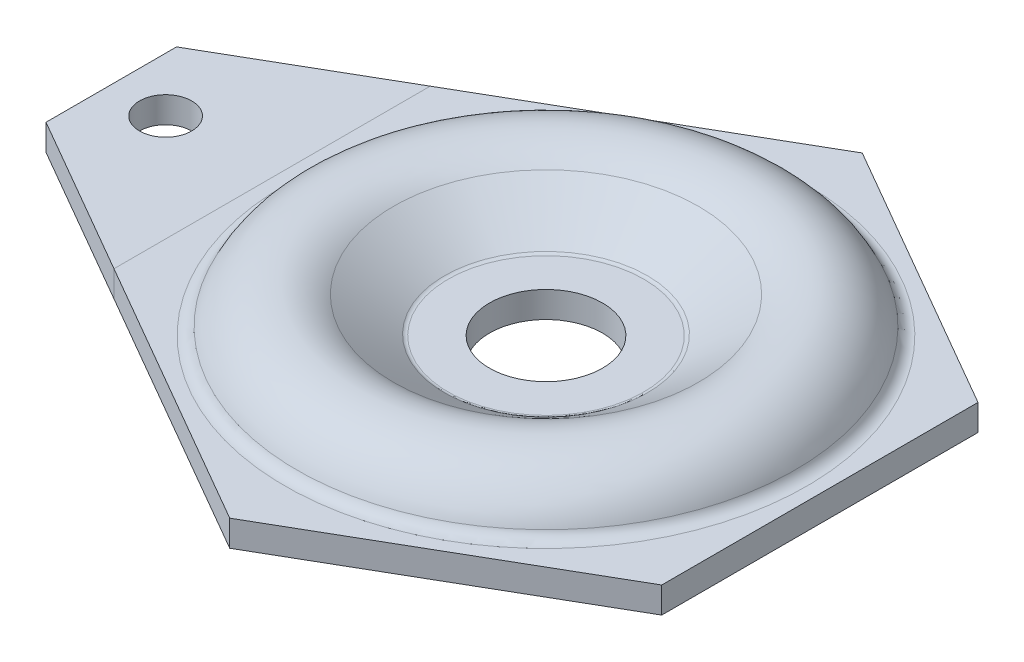
ISO-10303-21;
HEADER;
FILE_DESCRIPTION(('STEP AP214'),'2;1');
FILE_NAME('part.step','',(''),(''),'','','');
FILE_SCHEMA(('AUTOMOTIVE_DESIGN { 1 0 10303 214 1 1 1 1 }'));
ENDSEC;
DATA;
#1=APPLICATION_CONTEXT('core data for automotive mechanical design processes');
#2=APPLICATION_PROTOCOL_DEFINITION('international standard','automotive_design',2000,#1);
#3=PRODUCT_CONTEXT('',#1,'mechanical');
#4=PRODUCT('Part','Part','',(#3));
#5=PRODUCT_RELATED_PRODUCT_CATEGORY('part','',(#4));
#6=PRODUCT_DEFINITION_FORMATION('','',#4);
#7=PRODUCT_DEFINITION_CONTEXT('part definition',#1,'design');
#8=PRODUCT_DEFINITION('design','',#6,#7);
#9=PRODUCT_DEFINITION_SHAPE('','',#8);
#10=(LENGTH_UNIT() NAMED_UNIT(*) SI_UNIT(.MILLI.,.METRE.));
#11=(NAMED_UNIT(*) PLANE_ANGLE_UNIT() SI_UNIT($,.RADIAN.));
#12=(NAMED_UNIT(*) SI_UNIT($,.STERADIAN.) SOLID_ANGLE_UNIT());
#13=UNCERTAINTY_MEASURE_WITH_UNIT(LENGTH_MEASURE(1.E-05),#10,'distance_accuracy_value','');
#14=(GEOMETRIC_REPRESENTATION_CONTEXT(3) GLOBAL_UNCERTAINTY_ASSIGNED_CONTEXT((#13)) GLOBAL_UNIT_ASSIGNED_CONTEXT((#10,
#11,#12)) REPRESENTATION_CONTEXT('',''));
#15=CARTESIAN_POINT('',(0.,0.,0.));
#16=DIRECTION('',(0.,0.,1.));
#17=DIRECTION('',(1.,0.,0.));
#18=AXIS2_PLACEMENT_3D('',#15,#16,#17);
#19=CARTESIAN_POINT('',(-126.,273.916758940791,0.));
#20=DIRECTION('',(0.5,0.,-0.866025403784439));
#21=DIRECTION('',(-0.866025403784439,0.,-0.5));
#22=AXIS2_PLACEMENT_3D('',#19,#20,#21);
#23=PLANE('',#22);
#24=DIRECTION('',(-0.866025403784439,0.,-0.5));
#25=VECTOR('',#24,1.);
#26=CARTESIAN_POINT('',(-122.25,0.,2.16506350946112));
#27=LINE('',#26,#25);
#28=CARTESIAN_POINT('',(-63.,0.,36.3730669589464));
#29=VERTEX_POINT('',#28);
#30=CARTESIAN_POINT('',(-100.,0.,15.0111069989303));
#31=VERTEX_POINT('',#30);
#32=EDGE_CURVE('E105',#29,#31,#27,.T.);
#33=ORIENTED_EDGE('',*,*,#32,.F.);
#34=DIRECTION('',(0.,1.,0.));
#35=VECTOR('',#34,1.);
#36=CARTESIAN_POINT('',(-63.,0.,36.3730669589464));
#37=LINE('',#36,#35);
#38=CARTESIAN_POINT('',(-63.,6.00000000000001,36.3730669589464));
#39=VERTEX_POINT('',#38);
#40=EDGE_CURVE('E97',#29,#39,#37,.T.);
#41=ORIENTED_EDGE('',*,*,#40,.T.);
#42=DIRECTION('',(0.866025403784439,0.,0.5));
#43=VECTOR('',#42,1.);
#44=CARTESIAN_POINT('',(-90.75,6.,20.3515969889343));
#45=LINE('',#44,#43);
#46=CARTESIAN_POINT('',(-100.,6.,15.0111069989303));
#47=VERTEX_POINT('',#46);
#48=EDGE_CURVE('E102',#47,#39,#45,.T.);
#49=ORIENTED_EDGE('',*,*,#48,.F.);
#50=DIRECTION('',(0.,-1.,0.));
#51=VECTOR('',#50,1.);
#52=CARTESIAN_POINT('',(-100.,0.,15.0111069989303));
#53=LINE('',#52,#51);
#54=EDGE_CURVE('E74',#47,#31,#53,.T.);
#55=ORIENTED_EDGE('',*,*,#54,.T.);
#56=EDGE_LOOP('',(#33,#41,#49,#55));
#57=FACE_BOUND('',#56,.T.);
#58=ADVANCED_FACE('F51',(#57),#23,.F.);
#59=CARTESIAN_POINT('',(-100.,0.,-36.3730669589464));
#60=DIRECTION('',(0.,1.,0.));
#61=DIRECTION('',(0.,0.,1.));
#62=AXIS2_PLACEMENT_3D('',#59,#60,#61);
#63=PLANE('',#62);
#64=CARTESIAN_POINT('',(-87.5,0.,0.));
#65=DIRECTION('',(0.,1.,0.));
#66=DIRECTION('',(0.,0.,1.));
#67=AXIS2_PLACEMENT_3D('',#64,#65,#66);
#68=CIRCLE('',#67,6.);
#69=CARTESIAN_POINT('',(-87.5,0.,6.));
#70=VERTEX_POINT('',#69);
#71=EDGE_CURVE('E121',#70,#70,#68,.T.);
#72=ORIENTED_EDGE('',*,*,#71,.T.);
#73=EDGE_LOOP('',(#72));
#74=FACE_BOUND('',#73,.T.);
#75=DIRECTION('',(0.,0.,1.));
#76=VECTOR('',#75,1.);
#77=CARTESIAN_POINT('',(-100.,0.,-36.3730669589464));
#78=LINE('',#77,#76);
#79=CARTESIAN_POINT('',(-100.,0.,-15.0111069989303));
#80=VERTEX_POINT('',#79);
#81=EDGE_CURVE('E60',#80,#31,#78,.T.);
#82=ORIENTED_EDGE('',*,*,#81,.F.);
#83=DIRECTION('',(0.866025403784439,0.,-0.5));
#84=VECTOR('',#83,1.);
#85=CARTESIAN_POINT('',(-90.75,0.,-20.3515969889343));
#86=LINE('',#85,#84);
#87=CARTESIAN_POINT('',(-63.,0.,-36.3730669589464));
#88=VERTEX_POINT('',#87);
#89=EDGE_CURVE('E110',#80,#88,#86,.T.);
#90=ORIENTED_EDGE('',*,*,#89,.T.);
#91=DIRECTION('',(0.,0.,1.));
#92=VECTOR('',#91,1.);
#93=CARTESIAN_POINT('',(-63.,0.,-36.3730669589464));
#94=LINE('',#93,#92);
#95=EDGE_CURVE('E107',#88,#29,#94,.T.);
#96=ORIENTED_EDGE('',*,*,#95,.T.);
#97=ORIENTED_EDGE('',*,*,#32,.T.);
#98=EDGE_LOOP('',(#82,#90,#96,#97));
#99=FACE_BOUND('',#98,.T.);
#100=ADVANCED_FACE('F53',(#74,#99),#63,.F.);
#101=CARTESIAN_POINT('',(-100.,6.,36.3730669589464));
#102=DIRECTION('',(0.,-1.,0.));
#103=DIRECTION('',(0.,0.,-1.));
#104=AXIS2_PLACEMENT_3D('',#101,#102,#103);
#105=PLANE('',#104);
#106=CARTESIAN_POINT('',(-87.5,6.,0.));
#107=DIRECTION('',(0.,1.,0.));
#108=DIRECTION('',(0.,0.,1.));
#109=AXIS2_PLACEMENT_3D('',#106,#107,#108);
#110=CIRCLE('',#109,6.);
#111=CARTESIAN_POINT('',(-87.5,6.,6.));
#112=VERTEX_POINT('',#111);
#113=EDGE_CURVE('E122',#112,#112,#110,.T.);
#114=ORIENTED_EDGE('',*,*,#113,.F.);
#115=EDGE_LOOP('',(#114));
#116=FACE_BOUND('',#115,.T.);
#117=DIRECTION('',(0.,0.,-1.));
#118=VECTOR('',#117,1.);
#119=CARTESIAN_POINT('',(-63.,6.,36.3730669589464));
#120=LINE('',#119,#118);
#121=CARTESIAN_POINT('',(-63.,6.,-36.3730669589464));
#122=VERTEX_POINT('',#121);
#123=EDGE_CURVE('E55',#39,#122,#120,.T.);
#124=ORIENTED_EDGE('',*,*,#123,.T.);
#125=DIRECTION('',(-0.866025403784439,0.,0.5));
#126=VECTOR('',#125,1.);
#127=CARTESIAN_POINT('',(-122.25,6.,-2.16506350946111));
#128=LINE('',#127,#126);
#129=CARTESIAN_POINT('',(-100.,6.,-15.0111069989303));
#130=VERTEX_POINT('',#129);
#131=EDGE_CURVE('E68',#122,#130,#128,.T.);
#132=ORIENTED_EDGE('',*,*,#131,.T.);
#133=DIRECTION('',(0.,0.,-1.));
#134=VECTOR('',#133,1.);
#135=CARTESIAN_POINT('',(-100.,6.,36.3730669589464));
#136=LINE('',#135,#134);
#137=EDGE_CURVE('E12',#47,#130,#136,.T.);
#138=ORIENTED_EDGE('',*,*,#137,.F.);
#139=ORIENTED_EDGE('',*,*,#48,.T.);
#140=EDGE_LOOP('',(#124,#132,#138,#139));
#141=FACE_BOUND('',#140,.T.);
#142=ADVANCED_FACE('F103',(#116,#141),#105,.F.);
#143=CARTESIAN_POINT('',(-100.,0.,0.));
#144=DIRECTION('',(-1.,0.,0.));
#145=DIRECTION('',(0.,0.,1.));
#146=AXIS2_PLACEMENT_3D('',#143,#144,#145);
#147=PLANE('',#146);
#148=DIRECTION('',(0.,1.,0.));
#149=VECTOR('',#148,1.);
#150=CARTESIAN_POINT('',(-100.,0.,-15.0111069989303));
#151=LINE('',#150,#149);
#152=EDGE_CURVE('E116',#80,#130,#151,.T.);
#153=ORIENTED_EDGE('',*,*,#152,.F.);
#154=ORIENTED_EDGE('',*,*,#81,.T.);
#155=ORIENTED_EDGE('',*,*,#54,.F.);
#156=ORIENTED_EDGE('',*,*,#137,.T.);
#157=EDGE_LOOP('',(#153,#154,#155,#156));
#158=FACE_BOUND('',#157,.T.);
#159=ADVANCED_FACE('F138',(#158),#147,.T.);
#160=CARTESIAN_POINT('',(-63.,0.,0.));
#161=DIRECTION('',(-1.,0.,0.));
#162=DIRECTION('',(0.,0.,1.));
#163=AXIS2_PLACEMENT_3D('',#160,#161,#162);
#164=PLANE('',#163);
#165=DIRECTION('',(0.,-1.,0.));
#166=VECTOR('',#165,1.);
#167=CARTESIAN_POINT('',(-63.,6.,-36.3730669589464));
#168=LINE('',#167,#166);
#169=EDGE_CURVE('E100',#122,#88,#168,.T.);
#170=ORIENTED_EDGE('',*,*,#169,.F.);
#171=ORIENTED_EDGE('',*,*,#123,.F.);
#172=ORIENTED_EDGE('',*,*,#40,.F.);
#173=ORIENTED_EDGE('',*,*,#95,.F.);
#174=EDGE_LOOP('',(#170,#171,#172,#173));
#175=FACE_BOUND('',#174,.T.);
#176=ADVANCED_FACE('F95',(#175),#164,.F.);
#177=CARTESIAN_POINT('',(-63.,273.916758940791,-36.3730669589464));
#178=DIRECTION('',(0.5,0.,0.866025403784439));
#179=DIRECTION('',(0.866025403784439,0.,-0.5));
#180=AXIS2_PLACEMENT_3D('',#177,#178,#179);
#181=PLANE('',#180);
#182=ORIENTED_EDGE('',*,*,#89,.F.);
#183=ORIENTED_EDGE('',*,*,#152,.T.);
#184=ORIENTED_EDGE('',*,*,#131,.F.);
#185=ORIENTED_EDGE('',*,*,#169,.T.);
#186=EDGE_LOOP('',(#182,#183,#184,#185));
#187=FACE_BOUND('',#186,.T.);
#188=ADVANCED_FACE('F133',(#187),#181,.F.);
#189=CARTESIAN_POINT('',(-87.5,0.,0.));
#190=DIRECTION('',(0.,1.,0.));
#191=DIRECTION('',(0.,0.,1.));
#192=AXIS2_PLACEMENT_3D('',#189,#190,#191);
#193=CYLINDRICAL_SURFACE('',#192,6.);
#194=ORIENTED_EDGE('',*,*,#71,.F.);
#195=EDGE_LOOP('',(#194));
#196=FACE_BOUND('',#195,.T.);
#197=ORIENTED_EDGE('',*,*,#113,.T.);
#198=EDGE_LOOP('',(#197));
#199=FACE_BOUND('',#198,.T.);
#200=ADVANCED_FACE('F130',(#196,#199),#193,.F.);
#201=CLOSED_SHELL('',(#58,#100,#142,#159,#176,#188,#200));
#202=MANIFOLD_SOLID_BREP('B2',#201);
#203=CARTESIAN_POINT('',(0.,0.,0.));
#204=DIRECTION('',(0.,-1.,0.));
#205=DIRECTION('',(0.,0.,-1.));
#206=AXIS2_PLACEMENT_3D('',#203,#204,#205);
#207=CYLINDRICAL_SURFACE('',#206,13.);
#208=CARTESIAN_POINT('',(0.,0.,0.));
#209=DIRECTION('',(0.,-1.,0.));
#210=DIRECTION('',(0.,0.,-1.));
#211=AXIS2_PLACEMENT_3D('',#208,#209,#210);
#212=CIRCLE('',#211,13.);
#213=CARTESIAN_POINT('',(0.,0.,-13.));
#214=VERTEX_POINT('',#213);
#215=EDGE_CURVE('E49',#214,#214,#212,.T.);
#216=ORIENTED_EDGE('',*,*,#215,.T.);
#217=EDGE_LOOP('',(#216));
#218=FACE_BOUND('',#217,.T.);
#219=CARTESIAN_POINT('',(0.,6.,0.));
#220=DIRECTION('',(0.,-1.,0.));
#221=DIRECTION('',(0.,0.,-1.));
#222=AXIS2_PLACEMENT_3D('',#219,#220,#221);
#223=CIRCLE('',#222,13.);
#224=CARTESIAN_POINT('',(0.,6.,-13.));
#225=VERTEX_POINT('',#224);
#226=EDGE_CURVE('E307',#225,#225,#223,.T.);
#227=ORIENTED_EDGE('',*,*,#226,.F.);
#228=EDGE_LOOP('',(#227));
#229=FACE_BOUND('',#228,.T.);
#230=ADVANCED_FACE('F203',(#218,#229),#207,.F.);
#231=CARTESIAN_POINT('',(13.,0.,0.));
#232=DIRECTION('',(0.,-1.,0.));
#233=DIRECTION('',(0.,0.,-1.));
#234=AXIS2_PLACEMENT_3D('',#231,#232,#233);
#235=PLANE('',#234);
#236=CARTESIAN_POINT('',(0.,0.,0.));
#237=DIRECTION('',(0.,-1.,0.));
#238=DIRECTION('',(0.,0.,-1.));
#239=AXIS2_PLACEMENT_3D('',#236,#237,#238);
#240=CIRCLE('',#239,22.5);
#241=CARTESIAN_POINT('',(0.,0.,-22.5));
#242=VERTEX_POINT('',#241);
#243=EDGE_CURVE('E211',#242,#242,#240,.T.);
#244=ORIENTED_EDGE('',*,*,#243,.T.);
#245=EDGE_LOOP('',(#244));
#246=FACE_BOUND('',#245,.T.);
#247=ORIENTED_EDGE('',*,*,#215,.F.);
#248=EDGE_LOOP('',(#247));
#249=FACE_BOUND('',#248,.T.);
#250=ADVANCED_FACE('F343',(#246,#249),#235,.T.);
#251=CARTESIAN_POINT('',(0.,7.5,0.));
#252=DIRECTION('',(0.,-1.,0.));
#253=DIRECTION('',(0.,0.,-1.));
#254=AXIS2_PLACEMENT_3D('',#251,#252,#253);
#255=TOROIDAL_SURFACE('',#254,22.5,7.5);
#256=CARTESIAN_POINT('',(0.,1.29305055803008,0.));
#257=DIRECTION('',(0.,-1.,0.));
#258=DIRECTION('',(0.,0.,-1.));
#259=AXIS2_PLACEMENT_3D('',#256,#257,#258);
#260=CIRCLE('',#259,26.7099618317544);
#261=CARTESIAN_POINT('',(0.,1.29305055803008,-26.7099618317544));
#262=VERTEX_POINT('',#261);
#263=EDGE_CURVE('E338',#262,#262,#260,.T.);
#264=ORIENTED_EDGE('',*,*,#263,.T.);
#265=EDGE_LOOP('',(#264));
#266=FACE_BOUND('',#265,.T.);
#267=ORIENTED_EDGE('',*,*,#243,.F.);
#268=EDGE_LOOP('',(#267));
#269=FACE_BOUND('',#268,.T.);
#270=ADVANCED_FACE('F346',(#266,#269),#255,.T.);
#271=CARTESIAN_POINT('',(0.,1.29305055803008,0.));
#272=DIRECTION('',(0.,1.,0.));
#273=DIRECTION('',(0.,0.,1.));
#274=AXIS2_PLACEMENT_3D('',#271,#272,#273);
#275=CONICAL_SURFACE('',#274,26.7099618317544,0.974806450608682);
#276=CARTESIAN_POINT('',(0.,9.25459204539484,0.));
#277=DIRECTION('',(0.,-1.,0.));
#278=DIRECTION('',(0.,0.,-1.));
#279=AXIS2_PLACEMENT_3D('',#276,#277,#278);
#280=CIRCLE('',#279,38.4480458018947);
#281=CARTESIAN_POINT('',(0.,9.25459204539484,-38.4480458018947));
#282=VERTEX_POINT('',#281);
#283=EDGE_CURVE('E335',#282,#282,#280,.T.);
#284=ORIENTED_EDGE('',*,*,#283,.T.);
#285=EDGE_LOOP('',(#284));
#286=FACE_BOUND('',#285,.T.);
#287=ORIENTED_EDGE('',*,*,#263,.F.);
#288=EDGE_LOOP('',(#287));
#289=FACE_BOUND('',#288,.T.);
#290=ADVANCED_FACE('F348',(#286,#289),#275,.T.);
#291=CARTESIAN_POINT('',(0.,1.80625271503094,0.));
#292=DIRECTION('',(0.,-1.,0.));
#293=DIRECTION('',(0.,0.,-1.));
#294=AXIS2_PLACEMENT_3D('',#291,#292,#293);
#295=TOROIDAL_SURFACE('',#294,43.5,8.99999999999999);
#296=CARTESIAN_POINT('',(0.,5.40312635751546,0.));
#297=DIRECTION('',(0.,-1.,0.));
#298=DIRECTION('',(0.,0.,-1.));
#299=AXIS2_PLACEMENT_3D('',#296,#297,#298);
#300=CIRCLE('',#299,51.75);
#301=CARTESIAN_POINT('',(0.,5.40312635751546,-51.75));
#302=VERTEX_POINT('',#301);
#303=EDGE_CURVE('E331',#302,#302,#300,.T.);
#304=ORIENTED_EDGE('',*,*,#303,.T.);
#305=EDGE_LOOP('',(#304));
#306=FACE_BOUND('',#305,.T.);
#307=ORIENTED_EDGE('',*,*,#283,.F.);
#308=EDGE_LOOP('',(#307));
#309=FACE_BOUND('',#308,.T.);
#310=ADVANCED_FACE('F355',(#306,#309),#295,.F.);
#311=CARTESIAN_POINT('',(0.,9.,0.));
#312=DIRECTION('',(0.,-1.,0.));
#313=DIRECTION('',(0.,0.,-1.));
#314=AXIS2_PLACEMENT_3D('',#311,#312,#313);
#315=TOROIDAL_SURFACE('',#314,60.,9.00000000000001);
#316=CARTESIAN_POINT('',(0.,0.,0.));
#317=DIRECTION('',(0.,-1.,0.));
#318=DIRECTION('',(0.,0.,-1.));
#319=AXIS2_PLACEMENT_3D('',#316,#317,#318);
#320=CIRCLE('',#319,60.);
#321=CARTESIAN_POINT('',(0.,0.,-60.));
#322=VERTEX_POINT('',#321);
#323=EDGE_CURVE('E327',#322,#322,#320,.T.);
#324=ORIENTED_EDGE('',*,*,#323,.T.);
#325=EDGE_LOOP('',(#324));
#326=FACE_BOUND('',#325,.T.);
#327=ORIENTED_EDGE('',*,*,#303,.F.);
#328=EDGE_LOOP('',(#327));
#329=FACE_BOUND('',#328,.T.);
#330=ADVANCED_FACE('F403',(#326,#329),#315,.T.);
#331=CARTESIAN_POINT('',(60.,0.,0.));
#332=DIRECTION('',(0.,-1.,0.));
#333=DIRECTION('',(0.,0.,-1.));
#334=AXIS2_PLACEMENT_3D('',#331,#332,#333);
#335=PLANE('',#334);
#336=ORIENTED_EDGE('',*,*,#323,.F.);
#337=EDGE_LOOP('',(#336));
#338=FACE_BOUND('',#337,.T.);
#339=DIRECTION('',(-0.866025403784439,0.,-0.5));
#340=VECTOR('',#339,1.);
#341=CARTESIAN_POINT('',(63.,0.,-36.3730669589464));
#342=LINE('',#341,#340);
#343=CARTESIAN_POINT('',(63.,0.,-36.3730669589464));
#344=VERTEX_POINT('',#343);
#345=CARTESIAN_POINT('',(0.,0.,-72.7461339178929));
#346=VERTEX_POINT('',#345);
#347=EDGE_CURVE('E288',#344,#346,#342,.T.);
#348=ORIENTED_EDGE('',*,*,#347,.F.);
#349=DIRECTION('',(0.,0.,-1.));
#350=VECTOR('',#349,1.);
#351=CARTESIAN_POINT('',(63.,0.,36.3730669589464));
#352=LINE('',#351,#350);
#353=CARTESIAN_POINT('',(63.,0.,36.3730669589464));
#354=VERTEX_POINT('',#353);
#355=EDGE_CURVE('E248',#354,#344,#352,.T.);
#356=ORIENTED_EDGE('',*,*,#355,.F.);
#357=DIRECTION('',(0.866025403784439,0.,-0.5));
#358=VECTOR('',#357,1.);
#359=CARTESIAN_POINT('',(0.,0.,72.7461339178929));
#360=LINE('',#359,#358);
#361=CARTESIAN_POINT('',(0.,0.,72.7461339178929));
#362=VERTEX_POINT('',#361);
#363=EDGE_CURVE('E242',#362,#354,#360,.T.);
#364=ORIENTED_EDGE('',*,*,#363,.F.);
#365=DIRECTION('',(0.866025403784439,0.,0.5));
#366=VECTOR('',#365,1.);
#367=CARTESIAN_POINT('',(-63.,0.,36.3730669589464));
#368=LINE('',#367,#366);
#369=CARTESIAN_POINT('',(-63.,0.,36.3730669589464));
#370=VERTEX_POINT('',#369);
#371=EDGE_CURVE('E278',#370,#362,#368,.T.);
#372=ORIENTED_EDGE('',*,*,#371,.F.);
#373=DIRECTION('',(0.,0.,1.));
#374=VECTOR('',#373,1.);
#375=CARTESIAN_POINT('',(-63.,0.,-36.3730669589464));
#376=LINE('',#375,#374);
#377=CARTESIAN_POINT('',(-63.,0.,-36.3730669589464));
#378=VERTEX_POINT('',#377);
#379=EDGE_CURVE('E293',#378,#370,#376,.T.);
#380=ORIENTED_EDGE('',*,*,#379,.F.);
#381=DIRECTION('',(-0.866025403784438,0.,0.5));
#382=VECTOR('',#381,1.);
#383=CARTESIAN_POINT('',(0.,0.,-72.7461339178929));
#384=LINE('',#383,#382);
#385=EDGE_CURVE('E291',#346,#378,#384,.T.);
#386=ORIENTED_EDGE('',*,*,#385,.F.);
#387=EDGE_LOOP('',(#348,#356,#364,#372,#380,#386));
#388=FACE_BOUND('',#387,.T.);
#389=ADVANCED_FACE('F398',(#338,#388),#335,.T.);
#390=CARTESIAN_POINT('',(62.5,6.,0.));
#391=DIRECTION('',(0.,1.,0.));
#392=DIRECTION('',(0.,0.,1.));
#393=AXIS2_PLACEMENT_3D('',#390,#391,#392);
#394=PLANE('',#393);
#395=CARTESIAN_POINT('',(0.,6.,0.));
#396=DIRECTION('',(0.,-1.,0.));
#397=DIRECTION('',(0.,0.,-1.));
#398=AXIS2_PLACEMENT_3D('',#395,#396,#397);
#399=CIRCLE('',#398,60.);
#400=CARTESIAN_POINT('',(0.,6.,-60.));
#401=VERTEX_POINT('',#400);
#402=EDGE_CURVE('E323',#401,#401,#399,.T.);
#403=ORIENTED_EDGE('',*,*,#402,.T.);
#404=EDGE_LOOP('',(#403));
#405=FACE_BOUND('',#404,.T.);
#406=DIRECTION('',(-0.866025403784439,0.,-0.5));
#407=VECTOR('',#406,1.);
#408=CARTESIAN_POINT('',(63.,6.,-36.3730669589464));
#409=LINE('',#408,#407);
#410=CARTESIAN_POINT('',(63.,6.,-36.3730669589464));
#411=VERTEX_POINT('',#410);
#412=CARTESIAN_POINT('',(0.,6.,-72.7461339178929));
#413=VERTEX_POINT('',#412);
#414=EDGE_CURVE('E298',#411,#413,#409,.T.);
#415=ORIENTED_EDGE('',*,*,#414,.T.);
#416=DIRECTION('',(-0.866025403784438,0.,0.5));
#417=VECTOR('',#416,1.);
#418=CARTESIAN_POINT('',(0.,6.,-72.7461339178929));
#419=LINE('',#418,#417);
#420=CARTESIAN_POINT('',(-63.,6.,-36.3730669589464));
#421=VERTEX_POINT('',#420);
#422=EDGE_CURVE('E257',#413,#421,#419,.T.);
#423=ORIENTED_EDGE('',*,*,#422,.T.);
#424=DIRECTION('',(0.,0.,1.));
#425=VECTOR('',#424,1.);
#426=CARTESIAN_POINT('',(-63.,6.,-36.3730669589464));
#427=LINE('',#426,#425);
#428=CARTESIAN_POINT('',(-63.,6.,36.3730669589464));
#429=VERTEX_POINT('',#428);
#430=EDGE_CURVE('E270',#421,#429,#427,.T.);
#431=ORIENTED_EDGE('',*,*,#430,.T.);
#432=DIRECTION('',(0.866025403784439,0.,0.5));
#433=VECTOR('',#432,1.);
#434=CARTESIAN_POINT('',(-63.,6.,36.3730669589464));
#435=LINE('',#434,#433);
#436=CARTESIAN_POINT('',(0.,6.,72.7461339178929));
#437=VERTEX_POINT('',#436);
#438=EDGE_CURVE('E264',#429,#437,#435,.T.);
#439=ORIENTED_EDGE('',*,*,#438,.T.);
#440=DIRECTION('',(0.866025403784439,0.,-0.5));
#441=VECTOR('',#440,1.);
#442=CARTESIAN_POINT('',(0.,6.,72.7461339178929));
#443=LINE('',#442,#441);
#444=CARTESIAN_POINT('',(63.,6.,36.3730669589464));
#445=VERTEX_POINT('',#444);
#446=EDGE_CURVE('E268',#437,#445,#443,.T.);
#447=ORIENTED_EDGE('',*,*,#446,.T.);
#448=DIRECTION('',(0.,0.,-1.));
#449=VECTOR('',#448,1.);
#450=CARTESIAN_POINT('',(63.,6.,36.3730669589464));
#451=LINE('',#450,#449);
#452=EDGE_CURVE('E219',#445,#411,#451,.T.);
#453=ORIENTED_EDGE('',*,*,#452,.T.);
#454=EDGE_LOOP('',(#415,#423,#431,#439,#447,#453));
#455=FACE_BOUND('',#454,.T.);
#456=ADVANCED_FACE('F266',(#405,#455),#394,.T.);
#457=CARTESIAN_POINT('',(0.,9.,0.));
#458=DIRECTION('',(0.,-1.,0.));
#459=DIRECTION('',(0.,0.,-1.));
#460=AXIS2_PLACEMENT_3D('',#457,#458,#459);
#461=TOROIDAL_SURFACE('',#460,60.,3.);
#462=CARTESIAN_POINT('',(0.,7.80104211917182,0.));
#463=DIRECTION('',(0.,-1.,0.));
#464=DIRECTION('',(0.,0.,-1.));
#465=AXIS2_PLACEMENT_3D('',#462,#463,#464);
#466=CIRCLE('',#465,57.25);
#467=CARTESIAN_POINT('',(0.,7.80104211917182,-57.25));
#468=VERTEX_POINT('',#467);
#469=EDGE_CURVE('E319',#468,#468,#466,.T.);
#470=ORIENTED_EDGE('',*,*,#469,.T.);
#471=EDGE_LOOP('',(#470));
#472=FACE_BOUND('',#471,.T.);
#473=ORIENTED_EDGE('',*,*,#402,.F.);
#474=EDGE_LOOP('',(#473));
#475=FACE_BOUND('',#474,.T.);
#476=ADVANCED_FACE('F388',(#472,#475),#461,.F.);
#477=CARTESIAN_POINT('',(0.,1.80625271503094,0.));
#478=DIRECTION('',(0.,-1.,0.));
#479=DIRECTION('',(0.,0.,-1.));
#480=AXIS2_PLACEMENT_3D('',#477,#478,#479);
#481=TOROIDAL_SURFACE('',#480,43.5,15.);
#482=CARTESIAN_POINT('',(0.,14.2201515989708,0.));
#483=DIRECTION('',(0.,-1.,0.));
#484=DIRECTION('',(0.,0.,-1.));
#485=AXIS2_PLACEMENT_3D('',#482,#483,#484);
#486=CIRCLE('',#485,35.0800763364911);
#487=CARTESIAN_POINT('',(0.,14.2201515989708,-35.0800763364911));
#488=VERTEX_POINT('',#487);
#489=EDGE_CURVE('E316',#488,#488,#486,.T.);
#490=ORIENTED_EDGE('',*,*,#489,.T.);
#491=EDGE_LOOP('',(#490));
#492=FACE_BOUND('',#491,.T.);
#493=ORIENTED_EDGE('',*,*,#469,.F.);
#494=EDGE_LOOP('',(#493));
#495=FACE_BOUND('',#494,.T.);
#496=ADVANCED_FACE('F382',(#492,#495),#481,.T.);
#497=CARTESIAN_POINT('',(0.,14.2201515989708,0.));
#498=DIRECTION('',(0.,1.,0.));
#499=DIRECTION('',(0.,0.,1.));
#500=AXIS2_PLACEMENT_3D('',#497,#498,#499);
#501=CONICAL_SURFACE('',#500,35.0800763364911,0.974806450608682);
#502=CARTESIAN_POINT('',(0.,6.25861011160602,0.));
#503=DIRECTION('',(0.,-1.,0.));
#504=DIRECTION('',(0.,0.,-1.));
#505=AXIS2_PLACEMENT_3D('',#502,#503,#504);
#506=CIRCLE('',#505,23.3419923663509);
#507=CARTESIAN_POINT('',(0.,6.25861011160602,-23.3419923663509));
#508=VERTEX_POINT('',#507);
#509=EDGE_CURVE('E313',#508,#508,#506,.T.);
#510=ORIENTED_EDGE('',*,*,#509,.T.);
#511=EDGE_LOOP('',(#510));
#512=FACE_BOUND('',#511,.T.);
#513=ORIENTED_EDGE('',*,*,#489,.F.);
#514=EDGE_LOOP('',(#513));
#515=FACE_BOUND('',#514,.T.);
#516=ADVANCED_FACE('F376',(#512,#515),#501,.F.);
#517=CARTESIAN_POINT('',(0.,7.5,0.));
#518=DIRECTION('',(0.,-1.,0.));
#519=DIRECTION('',(0.,0.,-1.));
#520=AXIS2_PLACEMENT_3D('',#517,#518,#519);
#521=TOROIDAL_SURFACE('',#520,22.5,1.5);
#522=CARTESIAN_POINT('',(0.,6.,0.));
#523=DIRECTION('',(0.,-1.,0.));
#524=DIRECTION('',(0.,0.,-1.));
#525=AXIS2_PLACEMENT_3D('',#522,#523,#524);
#526=CIRCLE('',#525,22.5);
#527=CARTESIAN_POINT('',(0.,6.,-22.5));
#528=VERTEX_POINT('',#527);
#529=EDGE_CURVE('E310',#528,#528,#526,.T.);
#530=ORIENTED_EDGE('',*,*,#529,.T.);
#531=EDGE_LOOP('',(#530));
#532=FACE_BOUND('',#531,.T.);
#533=ORIENTED_EDGE('',*,*,#509,.F.);
#534=EDGE_LOOP('',(#533));
#535=FACE_BOUND('',#534,.T.);
#536=ADVANCED_FACE('F370',(#532,#535),#521,.F.);
#537=CARTESIAN_POINT('',(13.,6.,0.));
#538=DIRECTION('',(0.,1.,0.));
#539=DIRECTION('',(0.,0.,1.));
#540=AXIS2_PLACEMENT_3D('',#537,#538,#539);
#541=PLANE('',#540);
#542=ORIENTED_EDGE('',*,*,#226,.T.);
#543=EDGE_LOOP('',(#542));
#544=FACE_BOUND('',#543,.T.);
#545=ORIENTED_EDGE('',*,*,#529,.F.);
#546=EDGE_LOOP('',(#545));
#547=FACE_BOUND('',#546,.T.);
#548=ADVANCED_FACE('F366',(#544,#547),#541,.T.);
#549=CARTESIAN_POINT('',(63.,6.,-36.3730669589464));
#550=DIRECTION('',(-0.5,0.,0.866025403784439));
#551=DIRECTION('',(0.866025403784439,0.,0.5));
#552=AXIS2_PLACEMENT_3D('',#549,#550,#551);
#553=PLANE('',#552);
#554=ORIENTED_EDGE('',*,*,#347,.T.);
#555=DIRECTION('',(0.,-1.,0.));
#556=VECTOR('',#555,1.);
#557=CARTESIAN_POINT('',(0.,6.,-72.7461339178929));
#558=LINE('',#557,#556);
#559=EDGE_CURVE('E305',#413,#346,#558,.T.);
#560=ORIENTED_EDGE('',*,*,#559,.F.);
#561=ORIENTED_EDGE('',*,*,#414,.F.);
#562=DIRECTION('',(0.,-1.,0.));
#563=VECTOR('',#562,1.);
#564=CARTESIAN_POINT('',(63.,6.,-36.3730669589464));
#565=LINE('',#564,#563);
#566=EDGE_CURVE('E284',#411,#344,#565,.T.);
#567=ORIENTED_EDGE('',*,*,#566,.T.);
#568=EDGE_LOOP('',(#554,#560,#561,#567));
#569=FACE_BOUND('',#568,.T.);
#570=ADVANCED_FACE('F369',(#569),#553,.F.);
#571=CARTESIAN_POINT('',(0.,6.,-72.7461339178929));
#572=DIRECTION('',(0.5,0.,0.866025403784439));
#573=DIRECTION('',(0.866025403784439,0.,-0.5));
#574=AXIS2_PLACEMENT_3D('',#571,#572,#573);
#575=PLANE('',#574);
#576=ORIENTED_EDGE('',*,*,#385,.T.);
#577=DIRECTION('',(0.,-1.,0.));
#578=VECTOR('',#577,1.);
#579=CARTESIAN_POINT('',(-63.,6.,-36.3730669589464));
#580=LINE('',#579,#578);
#581=EDGE_CURVE('E302',#421,#378,#580,.T.);
#582=ORIENTED_EDGE('',*,*,#581,.F.);
#583=ORIENTED_EDGE('',*,*,#422,.F.);
#584=ORIENTED_EDGE('',*,*,#559,.T.);
#585=EDGE_LOOP('',(#576,#582,#583,#584));
#586=FACE_BOUND('',#585,.T.);
#587=ADVANCED_FACE('F451',(#586),#575,.F.);
#588=CARTESIAN_POINT('',(-63.,6.,-36.3730669589464));
#589=DIRECTION('',(1.,0.,0.));
#590=DIRECTION('',(0.,0.,-1.));
#591=AXIS2_PLACEMENT_3D('',#588,#589,#590);
#592=PLANE('',#591);
#593=ORIENTED_EDGE('',*,*,#379,.T.);
#594=DIRECTION('',(0.,-1.,0.));
#595=VECTOR('',#594,1.);
#596=CARTESIAN_POINT('',(-63.,6.,36.3730669589464));
#597=LINE('',#596,#595);
#598=EDGE_CURVE('E279',#429,#370,#597,.T.);
#599=ORIENTED_EDGE('',*,*,#598,.F.);
#600=ORIENTED_EDGE('',*,*,#430,.F.);
#601=ORIENTED_EDGE('',*,*,#581,.T.);
#602=EDGE_LOOP('',(#593,#599,#600,#601));
#603=FACE_BOUND('',#602,.T.);
#604=ADVANCED_FACE('F461',(#603),#592,.F.);
#605=CARTESIAN_POINT('',(-63.,6.,36.3730669589464));
#606=DIRECTION('',(0.5,0.,-0.866025403784438));
#607=DIRECTION('',(-0.866025403784439,0.,-0.5));
#608=AXIS2_PLACEMENT_3D('',#605,#606,#607);
#609=PLANE('',#608);
#610=ORIENTED_EDGE('',*,*,#371,.T.);
#611=DIRECTION('',(0.,-1.,0.));
#612=VECTOR('',#611,1.);
#613=CARTESIAN_POINT('',(0.,6.,72.7461339178929));
#614=LINE('',#613,#612);
#615=EDGE_CURVE('E275',#437,#362,#614,.T.);
#616=ORIENTED_EDGE('',*,*,#615,.F.);
#617=ORIENTED_EDGE('',*,*,#438,.F.);
#618=ORIENTED_EDGE('',*,*,#598,.T.);
#619=EDGE_LOOP('',(#610,#616,#617,#618));
#620=FACE_BOUND('',#619,.T.);
#621=ADVANCED_FACE('F276',(#620),#609,.F.);
#622=CARTESIAN_POINT('',(0.,6.,72.7461339178929));
#623=DIRECTION('',(-0.5,0.,-0.866025403784439));
#624=DIRECTION('',(-0.866025403784439,0.,0.5));
#625=AXIS2_PLACEMENT_3D('',#622,#623,#624);
#626=PLANE('',#625);
#627=ORIENTED_EDGE('',*,*,#363,.T.);
#628=DIRECTION('',(0.,-1.,0.));
#629=VECTOR('',#628,1.);
#630=CARTESIAN_POINT('',(63.,6.,36.3730669589464));
#631=LINE('',#630,#629);
#632=EDGE_CURVE('E280',#445,#354,#631,.T.);
#633=ORIENTED_EDGE('',*,*,#632,.F.);
#634=ORIENTED_EDGE('',*,*,#446,.F.);
#635=ORIENTED_EDGE('',*,*,#615,.T.);
#636=EDGE_LOOP('',(#627,#633,#634,#635));
#637=FACE_BOUND('',#636,.T.);
#638=ADVANCED_FACE('F282',(#637),#626,.F.);
#639=CARTESIAN_POINT('',(63.,6.,36.3730669589464));
#640=DIRECTION('',(-1.,0.,0.));
#641=DIRECTION('',(0.,0.,1.));
#642=AXIS2_PLACEMENT_3D('',#639,#640,#641);
#643=PLANE('',#642);
#644=ORIENTED_EDGE('',*,*,#355,.T.);
#645=ORIENTED_EDGE('',*,*,#566,.F.);
#646=ORIENTED_EDGE('',*,*,#452,.F.);
#647=ORIENTED_EDGE('',*,*,#632,.T.);
#648=EDGE_LOOP('',(#644,#645,#646,#647));
#649=FACE_BOUND('',#648,.T.);
#650=ADVANCED_FACE('F487',(#649),#643,.F.);
#651=CLOSED_SHELL('',(#230,#250,#270,#290,#310,#330,#389,#456,#476,#496,#516,#536,#548,#570,
#587,#604,#621,#638,#650));
#652=MANIFOLD_SOLID_BREP('B6',#651);
#653=ADVANCED_BREP_SHAPE_REPRESENTATION('',(#18,#202,#652),#14);
#654=SHAPE_DEFINITION_REPRESENTATION(#9,#653);
ENDSEC;
END-ISO-10303-21;
